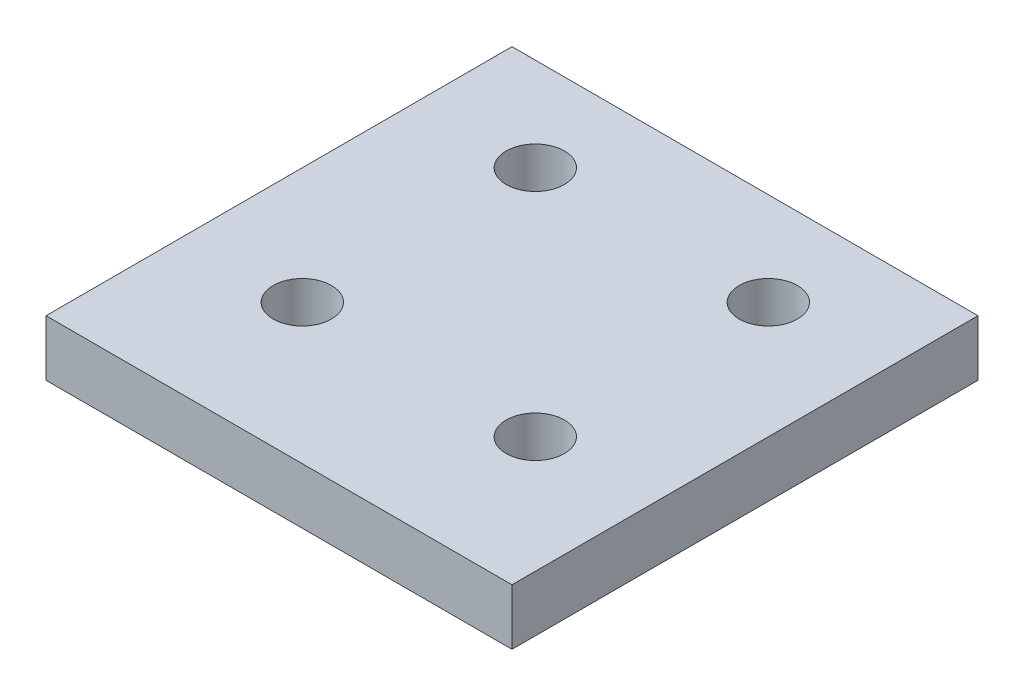
ISO-10303-21;
HEADER;
FILE_DESCRIPTION(('STEP AP214'),'2;1');
FILE_NAME('part.step','',(''),(''),'','','');
FILE_SCHEMA(('AUTOMOTIVE_DESIGN { 1 0 10303 214 1 1 1 1 }'));
ENDSEC;
DATA;
#1=APPLICATION_CONTEXT('core data for automotive mechanical design processes');
#2=APPLICATION_PROTOCOL_DEFINITION('international standard','automotive_design',2000,#1);
#3=PRODUCT_CONTEXT('',#1,'mechanical');
#4=PRODUCT('Part','Part','',(#3));
#5=PRODUCT_RELATED_PRODUCT_CATEGORY('part','',(#4));
#6=PRODUCT_DEFINITION_FORMATION('','',#4);
#7=PRODUCT_DEFINITION_CONTEXT('part definition',#1,'design');
#8=PRODUCT_DEFINITION('design','',#6,#7);
#9=PRODUCT_DEFINITION_SHAPE('','',#8);
#10=(LENGTH_UNIT() NAMED_UNIT(*) SI_UNIT(.MILLI.,.METRE.));
#11=(NAMED_UNIT(*) PLANE_ANGLE_UNIT() SI_UNIT($,.RADIAN.));
#12=(NAMED_UNIT(*) SI_UNIT($,.STERADIAN.) SOLID_ANGLE_UNIT());
#13=UNCERTAINTY_MEASURE_WITH_UNIT(LENGTH_MEASURE(1.E-05),#10,'distance_accuracy_value','');
#14=(GEOMETRIC_REPRESENTATION_CONTEXT(3) GLOBAL_UNCERTAINTY_ASSIGNED_CONTEXT((#13)) GLOBAL_UNIT_ASSIGNED_CONTEXT((#10,
#11,#12)) REPRESENTATION_CONTEXT('',''));
#15=CARTESIAN_POINT('',(0.,0.,0.));
#16=DIRECTION('',(0.,0.,1.));
#17=DIRECTION('',(1.,0.,0.));
#18=AXIS2_PLACEMENT_3D('',#15,#16,#17);
#19=CARTESIAN_POINT('',(0.,6.096,-50.8));
#20=DIRECTION('',(0.,1.,0.));
#21=DIRECTION('',(0.,0.,1.));
#22=AXIS2_PLACEMENT_3D('',#19,#20,#21);
#23=PLANE('',#22);
#24=CARTESIAN_POINT('',(-12.7,6.096,-15.24));
#25=DIRECTION('',(0.,1.,0.));
#26=DIRECTION('',(0.,0.,1.));
#27=AXIS2_PLACEMENT_3D('',#24,#25,#26);
#28=CIRCLE('',#27,3.175);
#29=CARTESIAN_POINT('',(-12.7,6.096,-12.065));
#30=VERTEX_POINT('',#29);
#31=EDGE_CURVE('E121',#30,#30,#28,.T.);
#32=ORIENTED_EDGE('',*,*,#31,.F.);
#33=EDGE_LOOP('',(#32));
#34=FACE_BOUND('',#33,.T.);
#35=CARTESIAN_POINT('',(-38.1,6.096,-40.64));
#36=DIRECTION('',(0.,1.,0.));
#37=DIRECTION('',(0.,0.,1.));
#38=AXIS2_PLACEMENT_3D('',#35,#36,#37);
#39=CIRCLE('',#38,3.175);
#40=CARTESIAN_POINT('',(-38.1,6.096,-37.465));
#41=VERTEX_POINT('',#40);
#42=EDGE_CURVE('E100',#41,#41,#39,.T.);
#43=ORIENTED_EDGE('',*,*,#42,.F.);
#44=EDGE_LOOP('',(#43));
#45=FACE_BOUND('',#44,.T.);
#46=DIRECTION('',(0.,0.,-1.));
#47=VECTOR('',#46,1.);
#48=CARTESIAN_POINT('',(0.,6.096,0.));
#49=LINE('',#48,#47);
#50=CARTESIAN_POINT('',(0.,6.096,0.));
#51=VERTEX_POINT('',#50);
#52=CARTESIAN_POINT('',(0.,6.096,-50.8));
#53=VERTEX_POINT('',#52);
#54=EDGE_CURVE('E85',#51,#53,#49,.T.);
#55=ORIENTED_EDGE('',*,*,#54,.T.);
#56=DIRECTION('',(-1.,0.,0.));
#57=VECTOR('',#56,1.);
#58=CARTESIAN_POINT('',(0.,6.096,-50.8));
#59=LINE('',#58,#57);
#60=CARTESIAN_POINT('',(-50.8,6.096,-50.8));
#61=VERTEX_POINT('',#60);
#62=EDGE_CURVE('E80',#53,#61,#59,.T.);
#63=ORIENTED_EDGE('',*,*,#62,.T.);
#64=DIRECTION('',(0.,0.,1.));
#65=VECTOR('',#64,1.);
#66=CARTESIAN_POINT('',(-50.8,6.096,0.));
#67=LINE('',#66,#65);
#68=CARTESIAN_POINT('',(-50.8,6.096,0.));
#69=VERTEX_POINT('',#68);
#70=EDGE_CURVE('E83',#61,#69,#67,.T.);
#71=ORIENTED_EDGE('',*,*,#70,.T.);
#72=DIRECTION('',(1.,0.,0.));
#73=VECTOR('',#72,1.);
#74=CARTESIAN_POINT('',(0.,6.096,0.));
#75=LINE('',#74,#73);
#76=EDGE_CURVE('E50',#69,#51,#75,.T.);
#77=ORIENTED_EDGE('',*,*,#76,.T.);
#78=EDGE_LOOP('',(#55,#63,#71,#77));
#79=FACE_BOUND('',#78,.T.);
#80=CARTESIAN_POINT('',(-12.7,6.096,-40.64));
#81=DIRECTION('',(0.,1.,0.));
#82=DIRECTION('',(0.,0.,1.));
#83=AXIS2_PLACEMENT_3D('',#80,#81,#82);
#84=CIRCLE('',#83,3.175);
#85=CARTESIAN_POINT('',(-12.7,6.096,-37.465));
#86=VERTEX_POINT('',#85);
#87=EDGE_CURVE('E115',#86,#86,#84,.T.);
#88=ORIENTED_EDGE('',*,*,#87,.F.);
#89=EDGE_LOOP('',(#88));
#90=FACE_BOUND('',#89,.T.);
#91=CARTESIAN_POINT('',(-38.1,6.096,-15.24));
#92=DIRECTION('',(0.,1.,0.));
#93=DIRECTION('',(0.,0.,1.));
#94=AXIS2_PLACEMENT_3D('',#91,#92,#93);
#95=CIRCLE('',#94,3.175);
#96=CARTESIAN_POINT('',(-38.1,6.096,-12.065));
#97=VERTEX_POINT('',#96);
#98=EDGE_CURVE('E127',#97,#97,#95,.T.);
#99=ORIENTED_EDGE('',*,*,#98,.F.);
#100=EDGE_LOOP('',(#99));
#101=FACE_BOUND('',#100,.T.);
#102=ADVANCED_FACE('F33',(#34,#45,#79,#90,#101),#23,.T.);
#103=CARTESIAN_POINT('',(0.,0.,-50.8));
#104=DIRECTION('',(0.,1.,0.));
#105=DIRECTION('',(0.,0.,1.));
#106=AXIS2_PLACEMENT_3D('',#103,#104,#105);
#107=PLANE('',#106);
#108=CARTESIAN_POINT('',(-12.7,0.,-15.24));
#109=DIRECTION('',(0.,1.,0.));
#110=DIRECTION('',(0.,0.,1.));
#111=AXIS2_PLACEMENT_3D('',#108,#109,#110);
#112=CIRCLE('',#111,3.175);
#113=CARTESIAN_POINT('',(-12.7,0.,-12.065));
#114=VERTEX_POINT('',#113);
#115=EDGE_CURVE('E124',#114,#114,#112,.T.);
#116=ORIENTED_EDGE('',*,*,#115,.T.);
#117=EDGE_LOOP('',(#116));
#118=FACE_BOUND('',#117,.T.);
#119=CARTESIAN_POINT('',(-38.1,0.,-40.64));
#120=DIRECTION('',(0.,1.,0.));
#121=DIRECTION('',(0.,0.,1.));
#122=AXIS2_PLACEMENT_3D('',#119,#120,#121);
#123=CIRCLE('',#122,3.175);
#124=CARTESIAN_POINT('',(-38.1,0.,-37.465));
#125=VERTEX_POINT('',#124);
#126=EDGE_CURVE('E112',#125,#125,#123,.T.);
#127=ORIENTED_EDGE('',*,*,#126,.T.);
#128=EDGE_LOOP('',(#127));
#129=FACE_BOUND('',#128,.T.);
#130=DIRECTION('',(0.,0.,-1.));
#131=VECTOR('',#130,1.);
#132=CARTESIAN_POINT('',(0.,0.,0.));
#133=LINE('',#132,#131);
#134=CARTESIAN_POINT('',(0.,0.,0.));
#135=VERTEX_POINT('',#134);
#136=CARTESIAN_POINT('',(0.,0.,-50.8));
#137=VERTEX_POINT('',#136);
#138=EDGE_CURVE('E97',#135,#137,#133,.T.);
#139=ORIENTED_EDGE('',*,*,#138,.F.);
#140=DIRECTION('',(1.,0.,0.));
#141=VECTOR('',#140,1.);
#142=CARTESIAN_POINT('',(0.,0.,0.));
#143=LINE('',#142,#141);
#144=CARTESIAN_POINT('',(-50.8,0.,0.));
#145=VERTEX_POINT('',#144);
#146=EDGE_CURVE('E73',#145,#135,#143,.T.);
#147=ORIENTED_EDGE('',*,*,#146,.F.);
#148=DIRECTION('',(0.,0.,1.));
#149=VECTOR('',#148,1.);
#150=CARTESIAN_POINT('',(-50.8,0.,0.));
#151=LINE('',#150,#149);
#152=CARTESIAN_POINT('',(-50.8,0.,-50.8));
#153=VERTEX_POINT('',#152);
#154=EDGE_CURVE('E67',#153,#145,#151,.T.);
#155=ORIENTED_EDGE('',*,*,#154,.F.);
#156=DIRECTION('',(-1.,0.,0.));
#157=VECTOR('',#156,1.);
#158=CARTESIAN_POINT('',(0.,0.,-50.8));
#159=LINE('',#158,#157);
#160=EDGE_CURVE('E89',#137,#153,#159,.T.);
#161=ORIENTED_EDGE('',*,*,#160,.F.);
#162=EDGE_LOOP('',(#139,#147,#155,#161));
#163=FACE_BOUND('',#162,.T.);
#164=CARTESIAN_POINT('',(-12.7,0.,-40.64));
#165=DIRECTION('',(0.,1.,0.));
#166=DIRECTION('',(0.,0.,1.));
#167=AXIS2_PLACEMENT_3D('',#164,#165,#166);
#168=CIRCLE('',#167,3.175);
#169=CARTESIAN_POINT('',(-12.7,0.,-37.465));
#170=VERTEX_POINT('',#169);
#171=EDGE_CURVE('E118',#170,#170,#168,.T.);
#172=ORIENTED_EDGE('',*,*,#171,.T.);
#173=EDGE_LOOP('',(#172));
#174=FACE_BOUND('',#173,.T.);
#175=CARTESIAN_POINT('',(-38.1,0.,-15.24));
#176=DIRECTION('',(0.,1.,0.));
#177=DIRECTION('',(0.,0.,1.));
#178=AXIS2_PLACEMENT_3D('',#175,#176,#177);
#179=CIRCLE('',#178,3.175);
#180=CARTESIAN_POINT('',(-38.1,0.,-12.065));
#181=VERTEX_POINT('',#180);
#182=EDGE_CURVE('E130',#181,#181,#179,.T.);
#183=ORIENTED_EDGE('',*,*,#182,.T.);
#184=EDGE_LOOP('',(#183));
#185=FACE_BOUND('',#184,.T.);
#186=ADVANCED_FACE('F108',(#118,#129,#163,#174,#185),#107,.F.);
#187=CARTESIAN_POINT('',(0.,6.096,0.));
#188=DIRECTION('',(-1.,0.,0.));
#189=DIRECTION('',(0.,0.,1.));
#190=AXIS2_PLACEMENT_3D('',#187,#188,#189);
#191=PLANE('',#190);
#192=ORIENTED_EDGE('',*,*,#138,.T.);
#193=DIRECTION('',(0.,-1.,0.));
#194=VECTOR('',#193,1.);
#195=CARTESIAN_POINT('',(0.,6.096,-50.8));
#196=LINE('',#195,#194);
#197=EDGE_CURVE('E11',#53,#137,#196,.T.);
#198=ORIENTED_EDGE('',*,*,#197,.F.);
#199=ORIENTED_EDGE('',*,*,#54,.F.);
#200=DIRECTION('',(0.,-1.,0.));
#201=VECTOR('',#200,1.);
#202=CARTESIAN_POINT('',(0.,6.096,0.));
#203=LINE('',#202,#201);
#204=EDGE_CURVE('E93',#51,#135,#203,.T.);
#205=ORIENTED_EDGE('',*,*,#204,.T.);
#206=EDGE_LOOP('',(#192,#198,#199,#205));
#207=FACE_BOUND('',#206,.T.);
#208=ADVANCED_FACE('F35',(#207),#191,.F.);
#209=CARTESIAN_POINT('',(0.,6.096,-50.8));
#210=DIRECTION('',(0.,0.,1.));
#211=DIRECTION('',(1.,0.,0.));
#212=AXIS2_PLACEMENT_3D('',#209,#210,#211);
#213=PLANE('',#212);
#214=ORIENTED_EDGE('',*,*,#160,.T.);
#215=DIRECTION('',(0.,-1.,0.));
#216=VECTOR('',#215,1.);
#217=CARTESIAN_POINT('',(-50.8,6.096,-50.8));
#218=LINE('',#217,#216);
#219=EDGE_CURVE('E42',#61,#153,#218,.T.);
#220=ORIENTED_EDGE('',*,*,#219,.F.);
#221=ORIENTED_EDGE('',*,*,#62,.F.);
#222=ORIENTED_EDGE('',*,*,#197,.T.);
#223=EDGE_LOOP('',(#214,#220,#221,#222));
#224=FACE_BOUND('',#223,.T.);
#225=ADVANCED_FACE('F88',(#224),#213,.F.);
#226=CARTESIAN_POINT('',(-50.8,6.096,0.));
#227=DIRECTION('',(1.,0.,0.));
#228=DIRECTION('',(0.,0.,-1.));
#229=AXIS2_PLACEMENT_3D('',#226,#227,#228);
#230=PLANE('',#229);
#231=ORIENTED_EDGE('',*,*,#154,.T.);
#232=DIRECTION('',(0.,-1.,0.));
#233=VECTOR('',#232,1.);
#234=CARTESIAN_POINT('',(-50.8,6.096,0.));
#235=LINE('',#234,#233);
#236=EDGE_CURVE('E90',#69,#145,#235,.T.);
#237=ORIENTED_EDGE('',*,*,#236,.F.);
#238=ORIENTED_EDGE('',*,*,#70,.F.);
#239=ORIENTED_EDGE('',*,*,#219,.T.);
#240=EDGE_LOOP('',(#231,#237,#238,#239));
#241=FACE_BOUND('',#240,.T.);
#242=ADVANCED_FACE('F91',(#241),#230,.F.);
#243=CARTESIAN_POINT('',(0.,6.096,0.));
#244=DIRECTION('',(0.,0.,-1.));
#245=DIRECTION('',(-1.,0.,0.));
#246=AXIS2_PLACEMENT_3D('',#243,#244,#245);
#247=PLANE('',#246);
#248=ORIENTED_EDGE('',*,*,#146,.T.);
#249=ORIENTED_EDGE('',*,*,#204,.F.);
#250=ORIENTED_EDGE('',*,*,#76,.F.);
#251=ORIENTED_EDGE('',*,*,#236,.T.);
#252=EDGE_LOOP('',(#248,#249,#250,#251));
#253=FACE_BOUND('',#252,.T.);
#254=ADVANCED_FACE('F105',(#253),#247,.F.);
#255=CARTESIAN_POINT('',(-38.1,6.096,-40.64));
#256=DIRECTION('',(0.,-1.,0.));
#257=DIRECTION('',(0.,0.,-1.));
#258=AXIS2_PLACEMENT_3D('',#255,#256,#257);
#259=CYLINDRICAL_SURFACE('',#258,3.175);
#260=ORIENTED_EDGE('',*,*,#42,.T.);
#261=EDGE_LOOP('',(#260));
#262=FACE_BOUND('',#261,.T.);
#263=ORIENTED_EDGE('',*,*,#126,.F.);
#264=EDGE_LOOP('',(#263));
#265=FACE_BOUND('',#264,.T.);
#266=ADVANCED_FACE('F150',(#262,#265),#259,.F.);
#267=CARTESIAN_POINT('',(-12.7,6.096,-40.64));
#268=DIRECTION('',(0.,-1.,0.));
#269=DIRECTION('',(0.,0.,-1.));
#270=AXIS2_PLACEMENT_3D('',#267,#268,#269);
#271=CYLINDRICAL_SURFACE('',#270,3.175);
#272=ORIENTED_EDGE('',*,*,#87,.T.);
#273=EDGE_LOOP('',(#272));
#274=FACE_BOUND('',#273,.T.);
#275=ORIENTED_EDGE('',*,*,#171,.F.);
#276=EDGE_LOOP('',(#275));
#277=FACE_BOUND('',#276,.T.);
#278=ADVANCED_FACE('F196',(#274,#277),#271,.F.);
#279=CARTESIAN_POINT('',(-12.7,6.096,-15.24));
#280=DIRECTION('',(0.,-1.,0.));
#281=DIRECTION('',(0.,0.,-1.));
#282=AXIS2_PLACEMENT_3D('',#279,#280,#281);
#283=CYLINDRICAL_SURFACE('',#282,3.175);
#284=ORIENTED_EDGE('',*,*,#31,.T.);
#285=EDGE_LOOP('',(#284));
#286=FACE_BOUND('',#285,.T.);
#287=ORIENTED_EDGE('',*,*,#115,.F.);
#288=EDGE_LOOP('',(#287));
#289=FACE_BOUND('',#288,.T.);
#290=ADVANCED_FACE('F204',(#286,#289),#283,.F.);
#291=CARTESIAN_POINT('',(-38.1,6.096,-15.24));
#292=DIRECTION('',(0.,-1.,0.));
#293=DIRECTION('',(0.,0.,-1.));
#294=AXIS2_PLACEMENT_3D('',#291,#292,#293);
#295=CYLINDRICAL_SURFACE('',#294,3.175);
#296=ORIENTED_EDGE('',*,*,#98,.T.);
#297=EDGE_LOOP('',(#296));
#298=FACE_BOUND('',#297,.T.);
#299=ORIENTED_EDGE('',*,*,#182,.F.);
#300=EDGE_LOOP('',(#299));
#301=FACE_BOUND('',#300,.T.);
#302=ADVANCED_FACE('F136',(#298,#301),#295,.F.);
#303=CLOSED_SHELL('',(#102,#186,#208,#225,#242,#254,#266,#278,#290,#302));
#304=MANIFOLD_SOLID_BREP('B2',#303);
#305=ADVANCED_BREP_SHAPE_REPRESENTATION('',(#18,#304),#14);
#306=SHAPE_DEFINITION_REPRESENTATION(#9,#305);
ENDSEC;
END-ISO-10303-21;
